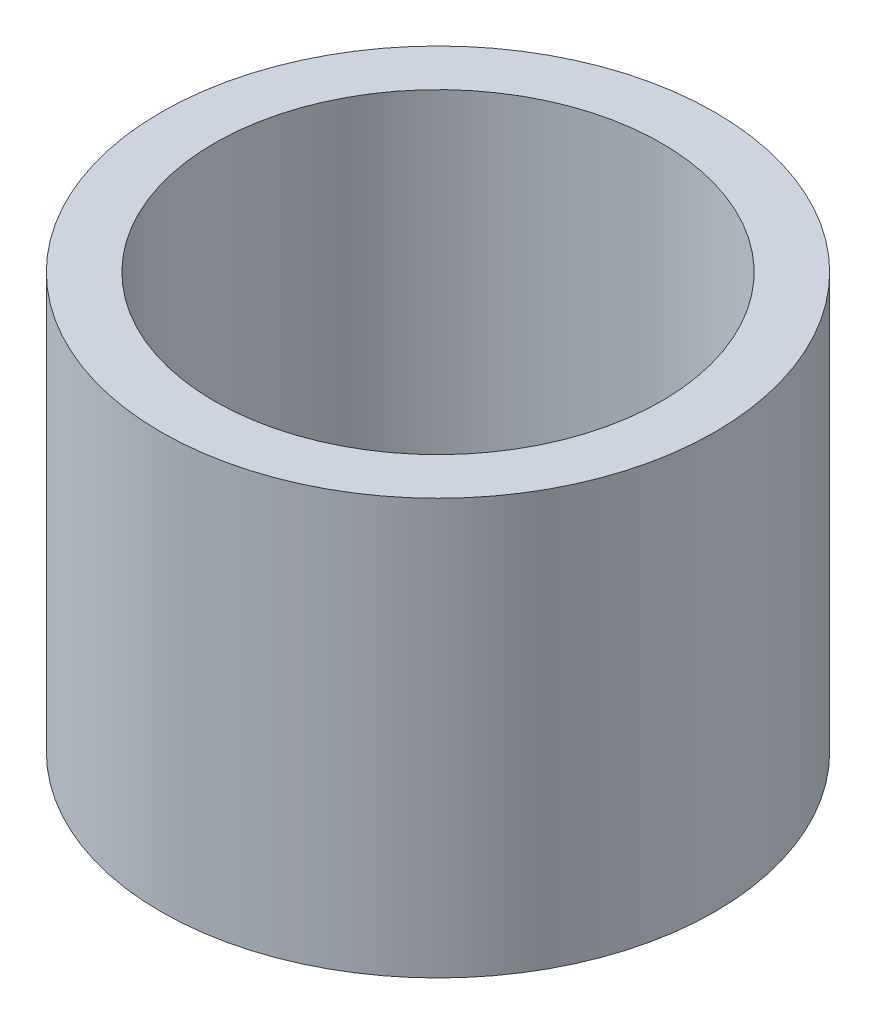
ISO-10303-21;
HEADER;
FILE_DESCRIPTION(('STEP AP214'),'2;1');
FILE_NAME('part.step','',(''),(''),'','','');
FILE_SCHEMA(('AUTOMOTIVE_DESIGN { 1 0 10303 214 1 1 1 1 }'));
ENDSEC;
DATA;
#1=APPLICATION_CONTEXT('core data for automotive mechanical design processes');
#2=APPLICATION_PROTOCOL_DEFINITION('international standard','automotive_design',2000,#1);
#3=PRODUCT_CONTEXT('',#1,'mechanical');
#4=PRODUCT('Part','Part','',(#3));
#5=PRODUCT_RELATED_PRODUCT_CATEGORY('part','',(#4));
#6=PRODUCT_DEFINITION_FORMATION('','',#4);
#7=PRODUCT_DEFINITION_CONTEXT('part definition',#1,'design');
#8=PRODUCT_DEFINITION('design','',#6,#7);
#9=PRODUCT_DEFINITION_SHAPE('','',#8);
#10=(LENGTH_UNIT() NAMED_UNIT(*) SI_UNIT(.MILLI.,.METRE.));
#11=(NAMED_UNIT(*) PLANE_ANGLE_UNIT() SI_UNIT($,.RADIAN.));
#12=(NAMED_UNIT(*) SI_UNIT($,.STERADIAN.) SOLID_ANGLE_UNIT());
#13=UNCERTAINTY_MEASURE_WITH_UNIT(LENGTH_MEASURE(1.E-05),#10,'distance_accuracy_value','');
#14=(GEOMETRIC_REPRESENTATION_CONTEXT(3) GLOBAL_UNCERTAINTY_ASSIGNED_CONTEXT((#13)) GLOBAL_UNIT_ASSIGNED_CONTEXT((#10,
#11,#12)) REPRESENTATION_CONTEXT('',''));
#15=CARTESIAN_POINT('',(0.,0.,0.));
#16=DIRECTION('',(0.,0.,1.));
#17=DIRECTION('',(1.,0.,0.));
#18=AXIS2_PLACEMENT_3D('',#15,#16,#17);
#19=CARTESIAN_POINT('',(20.5,0.,0.));
#20=DIRECTION('',(0.,1.,0.));
#21=DIRECTION('',(0.,0.,1.));
#22=AXIS2_PLACEMENT_3D('',#19,#20,#21);
#23=PLANE('',#22);
#24=CARTESIAN_POINT('',(0.,0.,0.));
#25=DIRECTION('',(0.,1.,0.));
#26=DIRECTION('',(0.,0.,1.));
#27=AXIS2_PLACEMENT_3D('',#24,#25,#26);
#28=CIRCLE('',#27,25.4);
#29=CARTESIAN_POINT('',(0.,0.,25.4));
#30=VERTEX_POINT('',#29);
#31=EDGE_CURVE('E10',#30,#30,#28,.T.);
#32=ORIENTED_EDGE('',*,*,#31,.F.);
#33=EDGE_LOOP('',(#32));
#34=FACE_BOUND('',#33,.T.);
#35=CARTESIAN_POINT('',(0.,0.,0.));
#36=DIRECTION('',(0.,1.,0.));
#37=DIRECTION('',(0.,0.,1.));
#38=AXIS2_PLACEMENT_3D('',#35,#36,#37);
#39=CIRCLE('',#38,20.5);
#40=CARTESIAN_POINT('',(0.,0.,20.5));
#41=VERTEX_POINT('',#40);
#42=EDGE_CURVE('E51',#41,#41,#39,.T.);
#43=ORIENTED_EDGE('',*,*,#42,.T.);
#44=EDGE_LOOP('',(#43));
#45=FACE_BOUND('',#44,.T.);
#46=ADVANCED_FACE('F37',(#34,#45),#23,.F.);
#47=CARTESIAN_POINT('',(0.,161.376166943427,0.));
#48=DIRECTION('',(0.,1.,0.));
#49=DIRECTION('',(0.,0.,1.));
#50=AXIS2_PLACEMENT_3D('',#47,#48,#49);
#51=CYLINDRICAL_SURFACE('',#50,25.4);
#52=CARTESIAN_POINT('',(0.,38.1,0.));
#53=DIRECTION('',(0.,1.,0.));
#54=DIRECTION('',(0.,0.,1.));
#55=AXIS2_PLACEMENT_3D('',#52,#53,#54);
#56=CIRCLE('',#55,25.4);
#57=CARTESIAN_POINT('',(0.,38.1,25.4));
#58=VERTEX_POINT('',#57);
#59=EDGE_CURVE('E43',#58,#58,#56,.T.);
#60=ORIENTED_EDGE('',*,*,#59,.F.);
#61=EDGE_LOOP('',(#60));
#62=FACE_BOUND('',#61,.T.);
#63=ORIENTED_EDGE('',*,*,#31,.T.);
#64=EDGE_LOOP('',(#63));
#65=FACE_BOUND('',#64,.T.);
#66=ADVANCED_FACE('F66',(#62,#65),#51,.T.);
#67=CARTESIAN_POINT('',(20.5,38.1,0.));
#68=DIRECTION('',(0.,-1.,0.));
#69=DIRECTION('',(0.,0.,-1.));
#70=AXIS2_PLACEMENT_3D('',#67,#68,#69);
#71=PLANE('',#70);
#72=CARTESIAN_POINT('',(0.,38.1,0.));
#73=DIRECTION('',(0.,1.,0.));
#74=DIRECTION('',(0.,0.,1.));
#75=AXIS2_PLACEMENT_3D('',#72,#73,#74);
#76=CIRCLE('',#75,20.5);
#77=CARTESIAN_POINT('',(0.,38.1,20.5));
#78=VERTEX_POINT('',#77);
#79=EDGE_CURVE('E47',#78,#78,#76,.T.);
#80=ORIENTED_EDGE('',*,*,#79,.F.);
#81=EDGE_LOOP('',(#80));
#82=FACE_BOUND('',#81,.T.);
#83=ORIENTED_EDGE('',*,*,#59,.T.);
#84=EDGE_LOOP('',(#83));
#85=FACE_BOUND('',#84,.T.);
#86=ADVANCED_FACE('F61',(#82,#85),#71,.F.);
#87=CARTESIAN_POINT('',(0.,161.376166943427,0.));
#88=DIRECTION('',(0.,1.,0.));
#89=DIRECTION('',(0.,0.,1.));
#90=AXIS2_PLACEMENT_3D('',#87,#88,#89);
#91=CYLINDRICAL_SURFACE('',#90,20.5);
#92=ORIENTED_EDGE('',*,*,#42,.F.);
#93=EDGE_LOOP('',(#92));
#94=FACE_BOUND('',#93,.T.);
#95=ORIENTED_EDGE('',*,*,#79,.T.);
#96=EDGE_LOOP('',(#95));
#97=FACE_BOUND('',#96,.T.);
#98=ADVANCED_FACE('F58',(#94,#97),#91,.F.);
#99=CLOSED_SHELL('',(#46,#66,#86,#98));
#100=MANIFOLD_SOLID_BREP('B2',#99);
#101=ADVANCED_BREP_SHAPE_REPRESENTATION('',(#18,#100),#14);
#102=SHAPE_DEFINITION_REPRESENTATION(#9,#101);
ENDSEC;
END-ISO-10303-21;
